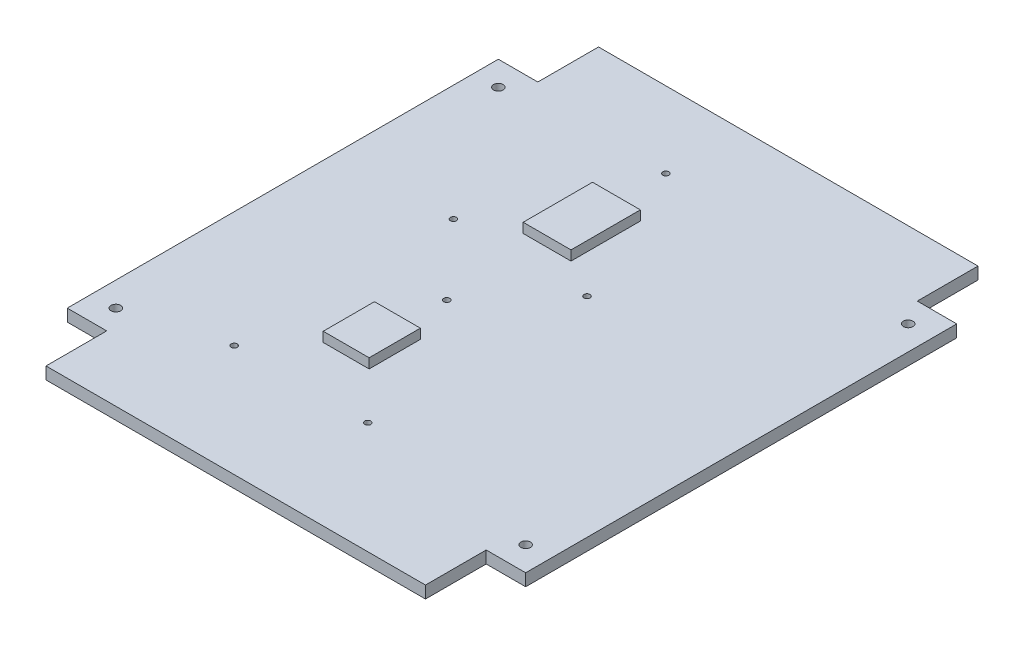
ISO-10303-21;
HEADER;
FILE_DESCRIPTION(('STEP AP214'),'2;1');
FILE_NAME('part.step','',(''),(''),'','','');
FILE_SCHEMA(('AUTOMOTIVE_DESIGN { 1 0 10303 214 1 1 1 1 }'));
ENDSEC;
DATA;
#1=APPLICATION_CONTEXT('core data for automotive mechanical design processes');
#2=APPLICATION_PROTOCOL_DEFINITION('international standard','automotive_design',2000,#1);
#3=PRODUCT_CONTEXT('',#1,'mechanical');
#4=PRODUCT('Part','Part','',(#3));
#5=PRODUCT_RELATED_PRODUCT_CATEGORY('part','',(#4));
#6=PRODUCT_DEFINITION_FORMATION('','',#4);
#7=PRODUCT_DEFINITION_CONTEXT('part definition',#1,'design');
#8=PRODUCT_DEFINITION('design','',#6,#7);
#9=PRODUCT_DEFINITION_SHAPE('','',#8);
#10=(LENGTH_UNIT() NAMED_UNIT(*) SI_UNIT(.MILLI.,.METRE.));
#11=(NAMED_UNIT(*) PLANE_ANGLE_UNIT() SI_UNIT($,.RADIAN.));
#12=(NAMED_UNIT(*) SI_UNIT($,.STERADIAN.) SOLID_ANGLE_UNIT());
#13=UNCERTAINTY_MEASURE_WITH_UNIT(LENGTH_MEASURE(1.E-05),#10,'distance_accuracy_value','');
#14=(GEOMETRIC_REPRESENTATION_CONTEXT(3) GLOBAL_UNCERTAINTY_ASSIGNED_CONTEXT((#13)) GLOBAL_UNIT_ASSIGNED_CONTEXT((#10,
#11,#12)) REPRESENTATION_CONTEXT('',''));
#15=CARTESIAN_POINT('',(0.,0.,0.));
#16=DIRECTION('',(0.,0.,1.));
#17=DIRECTION('',(1.,0.,0.));
#18=AXIS2_PLACEMENT_3D('',#15,#16,#17);
#19=CARTESIAN_POINT('',(-47.9425,2.54,-45.085));
#20=DIRECTION('',(0.,-1.,0.));
#21=DIRECTION('',(0.,0.,-1.));
#22=AXIS2_PLACEMENT_3D('',#19,#20,#21);
#23=PLANE('',#22);
#24=CARTESIAN_POINT('',(-42.8625,2.54,-40.005));
#25=DIRECTION('',(0.,1.,0.));
#26=DIRECTION('',(0.,0.,1.));
#27=AXIS2_PLACEMENT_3D('',#24,#25,#26);
#28=CIRCLE('',#27,0.999490000000001);
#29=CARTESIAN_POINT('',(-42.8625,2.54,-39.00551));
#30=VERTEX_POINT('',#29);
#31=EDGE_CURVE('E721',#30,#30,#28,.T.);
#32=ORIENTED_EDGE('',*,*,#31,.F.);
#33=EDGE_LOOP('',(#32));
#34=FACE_BOUND('',#33,.T.);
#35=CARTESIAN_POINT('',(-42.8625,2.54,40.005));
#36=DIRECTION('',(0.,1.,0.));
#37=DIRECTION('',(0.,0.,1.));
#38=AXIS2_PLACEMENT_3D('',#35,#36,#37);
#39=CIRCLE('',#38,0.999490000000001);
#40=CARTESIAN_POINT('',(-42.8625,2.54,41.00449));
#41=VERTEX_POINT('',#40);
#42=EDGE_CURVE('E723',#41,#41,#39,.T.);
#43=ORIENTED_EDGE('',*,*,#42,.F.);
#44=EDGE_LOOP('',(#43));
#45=FACE_BOUND('',#44,.T.);
#46=CARTESIAN_POINT('',(42.8625,2.54,-40.005));
#47=DIRECTION('',(0.,1.,0.));
#48=DIRECTION('',(0.,0.,1.));
#49=AXIS2_PLACEMENT_3D('',#46,#47,#48);
#50=CIRCLE('',#49,0.999490000000001);
#51=CARTESIAN_POINT('',(42.8625,2.54,-39.00551));
#52=VERTEX_POINT('',#51);
#53=EDGE_CURVE('E729',#52,#52,#50,.T.);
#54=ORIENTED_EDGE('',*,*,#53,.F.);
#55=EDGE_LOOP('',(#54));
#56=FACE_BOUND('',#55,.T.);
#57=CARTESIAN_POINT('',(42.8625,2.54,40.005));
#58=DIRECTION('',(0.,1.,0.));
#59=DIRECTION('',(0.,0.,1.));
#60=AXIS2_PLACEMENT_3D('',#57,#58,#59);
#61=CIRCLE('',#60,0.999490000000001);
#62=CARTESIAN_POINT('',(42.8625,2.54,41.00449));
#63=VERTEX_POINT('',#62);
#64=EDGE_CURVE('E735',#63,#63,#61,.T.);
#65=ORIENTED_EDGE('',*,*,#64,.F.);
#66=EDGE_LOOP('',(#65));
#67=FACE_BOUND('',#66,.T.);
#68=CARTESIAN_POINT('',(-9.7155,2.54,-41.91));
#69=DIRECTION('',(0.,1.,0.));
#70=DIRECTION('',(0.,0.,1.));
#71=AXIS2_PLACEMENT_3D('',#68,#69,#70);
#72=CIRCLE('',#71,0.635000000000001);
#73=CARTESIAN_POINT('',(-9.7155,2.54,-41.275));
#74=VERTEX_POINT('',#73);
#75=EDGE_CURVE('E741',#74,#74,#72,.T.);
#76=ORIENTED_EDGE('',*,*,#75,.F.);
#77=EDGE_LOOP('',(#76));
#78=FACE_BOUND('',#77,.T.);
#79=CARTESIAN_POINT('',(-23.6855,2.54,-11.43));
#80=DIRECTION('',(0.,1.,0.));
#81=DIRECTION('',(0.,0.,1.));
#82=AXIS2_PLACEMENT_3D('',#79,#80,#81);
#83=CIRCLE('',#82,0.634999999999999);
#84=CARTESIAN_POINT('',(-23.6855,2.54,-10.795));
#85=VERTEX_POINT('',#84);
#86=EDGE_CURVE('E747',#85,#85,#83,.T.);
#87=ORIENTED_EDGE('',*,*,#86,.F.);
#88=EDGE_LOOP('',(#87));
#89=FACE_BOUND('',#88,.T.);
#90=CARTESIAN_POINT('',(4.25449999999999,2.54,-11.43));
#91=DIRECTION('',(0.,1.,0.));
#92=DIRECTION('',(0.,0.,1.));
#93=AXIS2_PLACEMENT_3D('',#90,#91,#92);
#94=CIRCLE('',#93,0.635000000000001);
#95=CARTESIAN_POINT('',(4.25449999999999,2.54,-10.795));
#96=VERTEX_POINT('',#95);
#97=EDGE_CURVE('E753',#96,#96,#94,.T.);
#98=ORIENTED_EDGE('',*,*,#97,.F.);
#99=EDGE_LOOP('',(#98));
#100=FACE_BOUND('',#99,.T.);
#101=CARTESIAN_POINT('',(-9.7155,2.54,3.93700000000002));
#102=DIRECTION('',(0.,1.,0.));
#103=DIRECTION('',(0.,0.,1.));
#104=AXIS2_PLACEMENT_3D('',#101,#102,#103);
#105=CIRCLE('',#104,0.635000000000001);
#106=CARTESIAN_POINT('',(-9.7155,2.54,4.57200000000002));
#107=VERTEX_POINT('',#106);
#108=EDGE_CURVE('E759',#107,#107,#105,.T.);
#109=ORIENTED_EDGE('',*,*,#108,.F.);
#110=EDGE_LOOP('',(#109));
#111=FACE_BOUND('',#110,.T.);
#112=CARTESIAN_POINT('',(-23.6855,2.54,34.417));
#113=DIRECTION('',(0.,1.,0.));
#114=DIRECTION('',(0.,0.,1.));
#115=AXIS2_PLACEMENT_3D('',#112,#113,#114);
#116=CIRCLE('',#115,0.634999999999999);
#117=CARTESIAN_POINT('',(-23.6855,2.54,35.052));
#118=VERTEX_POINT('',#117);
#119=EDGE_CURVE('E765',#118,#118,#116,.T.);
#120=ORIENTED_EDGE('',*,*,#119,.F.);
#121=EDGE_LOOP('',(#120));
#122=FACE_BOUND('',#121,.T.);
#123=CARTESIAN_POINT('',(4.25449999999999,2.54,34.417));
#124=DIRECTION('',(0.,1.,0.));
#125=DIRECTION('',(0.,0.,1.));
#126=AXIS2_PLACEMENT_3D('',#123,#124,#125);
#127=CIRCLE('',#126,0.635000000000001);
#128=CARTESIAN_POINT('',(4.25449999999999,2.54,35.052));
#129=VERTEX_POINT('',#128);
#130=EDGE_CURVE('E771',#129,#129,#127,.T.);
#131=ORIENTED_EDGE('',*,*,#130,.F.);
#132=EDGE_LOOP('',(#131));
#133=FACE_BOUND('',#132,.T.);
#134=DIRECTION('',(0.,0.,-1.));
#135=VECTOR('',#134,1.);
#136=CARTESIAN_POINT('',(-5.3467,2.54,-45.085));
#137=LINE('',#136,#135);
#138=CARTESIAN_POINT('',(-5.3467,2.54,24.5364));
#139=VERTEX_POINT('',#138);
#140=CARTESIAN_POINT('',(-5.3467,2.54,13.8176));
#141=VERTEX_POINT('',#140);
#142=EDGE_CURVE('E236',#139,#141,#137,.T.);
#143=ORIENTED_EDGE('',*,*,#142,.F.);
#144=DIRECTION('',(1.,0.,0.));
#145=VECTOR('',#144,1.);
#146=CARTESIAN_POINT('',(-47.9425,2.54,24.5364));
#147=LINE('',#146,#145);
#148=CARTESIAN_POINT('',(-14.9479,2.54,24.5364));
#149=VERTEX_POINT('',#148);
#150=EDGE_CURVE('E227',#149,#139,#147,.T.);
#151=ORIENTED_EDGE('',*,*,#150,.F.);
#152=DIRECTION('',(0.,0.,1.));
#153=VECTOR('',#152,1.);
#154=CARTESIAN_POINT('',(-14.9479,2.54,-45.085));
#155=LINE('',#154,#153);
#156=CARTESIAN_POINT('',(-14.9479,2.54,13.8176));
#157=VERTEX_POINT('',#156);
#158=EDGE_CURVE('E230',#157,#149,#155,.T.);
#159=ORIENTED_EDGE('',*,*,#158,.F.);
#160=DIRECTION('',(-1.,0.,0.));
#161=VECTOR('',#160,1.);
#162=CARTESIAN_POINT('',(-47.9425,2.54,13.8176));
#163=LINE('',#162,#161);
#164=EDGE_CURVE('E233',#141,#157,#163,.T.);
#165=ORIENTED_EDGE('',*,*,#164,.F.);
#166=EDGE_LOOP('',(#143,#151,#159,#165));
#167=FACE_BOUND('',#166,.T.);
#168=DIRECTION('',(0.,0.,1.));
#169=VECTOR('',#168,1.);
#170=CARTESIAN_POINT('',(-47.9425,2.54,45.085));
#171=LINE('',#170,#169);
#172=CARTESIAN_POINT('',(-47.9425,2.54,-45.085));
#173=VERTEX_POINT('',#172);
#174=CARTESIAN_POINT('',(-47.9425,2.54,45.085));
#175=VERTEX_POINT('',#174);
#176=EDGE_CURVE('E240',#173,#175,#171,.T.);
#177=ORIENTED_EDGE('',*,*,#176,.T.);
#178=DIRECTION('',(1.,0.,0.));
#179=VECTOR('',#178,1.);
#180=CARTESIAN_POINT('',(-47.9425,2.54,45.085));
#181=LINE('',#180,#179);
#182=CARTESIAN_POINT('',(-39.6875,2.54,45.085));
#183=VERTEX_POINT('',#182);
#184=EDGE_CURVE('E243',#175,#183,#181,.T.);
#185=ORIENTED_EDGE('',*,*,#184,.T.);
#186=DIRECTION('',(0.,0.,1.));
#187=VECTOR('',#186,1.);
#188=CARTESIAN_POINT('',(-39.6875,2.54,45.085));
#189=LINE('',#188,#187);
#190=CARTESIAN_POINT('',(-39.6875,2.54,57.785));
#191=VERTEX_POINT('',#190);
#192=EDGE_CURVE('E246',#183,#191,#189,.T.);
#193=ORIENTED_EDGE('',*,*,#192,.T.);
#194=DIRECTION('',(1.,0.,0.));
#195=VECTOR('',#194,1.);
#196=CARTESIAN_POINT('',(39.6875,2.54,57.785));
#197=LINE('',#196,#195);
#198=CARTESIAN_POINT('',(39.6875,2.54,57.785));
#199=VERTEX_POINT('',#198);
#200=EDGE_CURVE('E248',#191,#199,#197,.T.);
#201=ORIENTED_EDGE('',*,*,#200,.T.);
#202=DIRECTION('',(0.,0.,-1.));
#203=VECTOR('',#202,1.);
#204=CARTESIAN_POINT('',(39.6875,2.54,45.085));
#205=LINE('',#204,#203);
#206=CARTESIAN_POINT('',(39.6875,2.54,45.085));
#207=VERTEX_POINT('',#206);
#208=EDGE_CURVE('E250',#199,#207,#205,.T.);
#209=ORIENTED_EDGE('',*,*,#208,.T.);
#210=DIRECTION('',(1.,0.,0.));
#211=VECTOR('',#210,1.);
#212=CARTESIAN_POINT('',(47.9425,2.54,45.085));
#213=LINE('',#212,#211);
#214=CARTESIAN_POINT('',(47.9425,2.54,45.085));
#215=VERTEX_POINT('',#214);
#216=EDGE_CURVE('E252',#207,#215,#213,.T.);
#217=ORIENTED_EDGE('',*,*,#216,.T.);
#218=DIRECTION('',(0.,0.,-1.));
#219=VECTOR('',#218,1.);
#220=CARTESIAN_POINT('',(47.9425,2.54,45.085));
#221=LINE('',#220,#219);
#222=CARTESIAN_POINT('',(47.9425,2.54,-45.085));
#223=VERTEX_POINT('',#222);
#224=EDGE_CURVE('E254',#215,#223,#221,.T.);
#225=ORIENTED_EDGE('',*,*,#224,.T.);
#226=DIRECTION('',(-1.,0.,0.));
#227=VECTOR('',#226,1.);
#228=CARTESIAN_POINT('',(47.9425,2.54,-45.085));
#229=LINE('',#228,#227);
#230=CARTESIAN_POINT('',(39.6875,2.54,-45.085));
#231=VERTEX_POINT('',#230);
#232=EDGE_CURVE('E256',#223,#231,#229,.T.);
#233=ORIENTED_EDGE('',*,*,#232,.T.);
#234=DIRECTION('',(0.,0.,-1.));
#235=VECTOR('',#234,1.);
#236=CARTESIAN_POINT('',(39.6875,2.54,-45.085));
#237=LINE('',#236,#235);
#238=CARTESIAN_POINT('',(39.6875,2.54,-57.785));
#239=VERTEX_POINT('',#238);
#240=EDGE_CURVE('E258',#231,#239,#237,.T.);
#241=ORIENTED_EDGE('',*,*,#240,.T.);
#242=DIRECTION('',(-1.,0.,0.));
#243=VECTOR('',#242,1.);
#244=CARTESIAN_POINT('',(39.6875,2.54,-57.785));
#245=LINE('',#244,#243);
#246=CARTESIAN_POINT('',(-39.6875,2.54,-57.785));
#247=VERTEX_POINT('',#246);
#248=EDGE_CURVE('E260',#239,#247,#245,.T.);
#249=ORIENTED_EDGE('',*,*,#248,.T.);
#250=DIRECTION('',(0.,0.,1.));
#251=VECTOR('',#250,1.);
#252=CARTESIAN_POINT('',(-39.6875,2.54,-45.085));
#253=LINE('',#252,#251);
#254=CARTESIAN_POINT('',(-39.6875,2.54,-45.085));
#255=VERTEX_POINT('',#254);
#256=EDGE_CURVE('E262',#247,#255,#253,.T.);
#257=ORIENTED_EDGE('',*,*,#256,.T.);
#258=DIRECTION('',(-1.,0.,0.));
#259=VECTOR('',#258,1.);
#260=CARTESIAN_POINT('',(-47.9425,2.54,-45.085));
#261=LINE('',#260,#259);
#262=EDGE_CURVE('E264',#255,#173,#261,.T.);
#263=ORIENTED_EDGE('',*,*,#262,.T.);
#264=EDGE_LOOP('',(#177,#185,#193,#201,#209,#217,#225,#233,#241,#249,#257,#263));
#265=FACE_BOUND('',#264,.T.);
#266=DIRECTION('',(0.,0.,1.));
#267=VECTOR('',#266,1.);
#268=CARTESIAN_POINT('',(-13.7795,2.54,-45.085));
#269=LINE('',#268,#267);
#270=CARTESIAN_POINT('',(-13.7795,2.54,-30.6197));
#271=VERTEX_POINT('',#270);
#272=CARTESIAN_POINT('',(-13.7795,2.54,-16.1163));
#273=VERTEX_POINT('',#272);
#274=EDGE_CURVE('E194',#271,#273,#269,.T.);
#275=ORIENTED_EDGE('',*,*,#274,.F.);
#276=DIRECTION('',(-1.,0.,0.));
#277=VECTOR('',#276,1.);
#278=CARTESIAN_POINT('',(-47.9425,2.54,-30.6197));
#279=LINE('',#278,#277);
#280=CARTESIAN_POINT('',(-3.7719,2.54,-30.6197));
#281=VERTEX_POINT('',#280);
#282=EDGE_CURVE('E195',#281,#271,#279,.T.);
#283=ORIENTED_EDGE('',*,*,#282,.F.);
#284=DIRECTION('',(0.,0.,-1.));
#285=VECTOR('',#284,1.);
#286=CARTESIAN_POINT('',(-3.7719,2.54,-45.085));
#287=LINE('',#286,#285);
#288=CARTESIAN_POINT('',(-3.7719,2.54,-16.1163));
#289=VERTEX_POINT('',#288);
#290=EDGE_CURVE('E57',#289,#281,#287,.T.);
#291=ORIENTED_EDGE('',*,*,#290,.F.);
#292=DIRECTION('',(1.,0.,0.));
#293=VECTOR('',#292,1.);
#294=CARTESIAN_POINT('',(-47.9425,2.54,-16.1163));
#295=LINE('',#294,#293);
#296=EDGE_CURVE('E52',#273,#289,#295,.T.);
#297=ORIENTED_EDGE('',*,*,#296,.F.);
#298=EDGE_LOOP('',(#275,#283,#291,#297));
#299=FACE_BOUND('',#298,.T.);
#300=ADVANCED_FACE('F37',(#34,#45,#56,#67,#78,#89,#100,#111,#122,#133,#167,#265,#299),#23,.F.);
#301=CARTESIAN_POINT('',(-47.9425,2.54,45.085));
#302=DIRECTION('',(1.,0.,0.));
#303=DIRECTION('',(0.,0.,-1.));
#304=AXIS2_PLACEMENT_3D('',#301,#302,#303);
#305=PLANE('',#304);
#306=DIRECTION('',(0.,0.,1.));
#307=VECTOR('',#306,1.);
#308=CARTESIAN_POINT('',(-47.9425,0.,45.085));
#309=LINE('',#308,#307);
#310=CARTESIAN_POINT('',(-47.9425,0.,-45.085));
#311=VERTEX_POINT('',#310);
#312=CARTESIAN_POINT('',(-47.9425,0.,45.085));
#313=VERTEX_POINT('',#312);
#314=EDGE_CURVE('E239',#311,#313,#309,.T.);
#315=ORIENTED_EDGE('',*,*,#314,.T.);
#316=DIRECTION('',(0.,-1.,0.));
#317=VECTOR('',#316,1.);
#318=CARTESIAN_POINT('',(-47.9425,2.54,45.085));
#319=LINE('',#318,#317);
#320=EDGE_CURVE('E11',#175,#313,#319,.T.);
#321=ORIENTED_EDGE('',*,*,#320,.F.);
#322=ORIENTED_EDGE('',*,*,#176,.F.);
#323=DIRECTION('',(0.,-1.,0.));
#324=VECTOR('',#323,1.);
#325=CARTESIAN_POINT('',(-47.9425,2.54,-45.085));
#326=LINE('',#325,#324);
#327=EDGE_CURVE('E266',#173,#311,#326,.T.);
#328=ORIENTED_EDGE('',*,*,#327,.T.);
#329=EDGE_LOOP('',(#315,#321,#322,#328));
#330=FACE_BOUND('',#329,.T.);
#331=ADVANCED_FACE('F39',(#330),#305,.F.);
#332=CARTESIAN_POINT('',(-47.9425,2.54,45.085));
#333=DIRECTION('',(0.,0.,-1.));
#334=DIRECTION('',(-1.,0.,0.));
#335=AXIS2_PLACEMENT_3D('',#332,#333,#334);
#336=PLANE('',#335);
#337=DIRECTION('',(1.,0.,0.));
#338=VECTOR('',#337,1.);
#339=CARTESIAN_POINT('',(-47.9425,0.,45.085));
#340=LINE('',#339,#338);
#341=CARTESIAN_POINT('',(-39.6875,0.,45.085));
#342=VERTEX_POINT('',#341);
#343=EDGE_CURVE('E269',#313,#342,#340,.T.);
#344=ORIENTED_EDGE('',*,*,#343,.T.);
#345=DIRECTION('',(0.,-1.,0.));
#346=VECTOR('',#345,1.);
#347=CARTESIAN_POINT('',(-39.6875,2.54,45.085));
#348=LINE('',#347,#346);
#349=EDGE_CURVE('E45',#183,#342,#348,.T.);
#350=ORIENTED_EDGE('',*,*,#349,.F.);
#351=ORIENTED_EDGE('',*,*,#184,.F.);
#352=ORIENTED_EDGE('',*,*,#320,.T.);
#353=EDGE_LOOP('',(#344,#350,#351,#352));
#354=FACE_BOUND('',#353,.T.);
#355=ADVANCED_FACE('F345',(#354),#336,.F.);
#356=CARTESIAN_POINT('',(-39.6875,2.54,45.085));
#357=DIRECTION('',(1.,0.,0.));
#358=DIRECTION('',(0.,0.,-1.));
#359=AXIS2_PLACEMENT_3D('',#356,#357,#358);
#360=PLANE('',#359);
#361=DIRECTION('',(0.,0.,1.));
#362=VECTOR('',#361,1.);
#363=CARTESIAN_POINT('',(-39.6875,0.,45.085));
#364=LINE('',#363,#362);
#365=CARTESIAN_POINT('',(-39.6875,0.,57.785));
#366=VERTEX_POINT('',#365);
#367=EDGE_CURVE('E271',#342,#366,#364,.T.);
#368=ORIENTED_EDGE('',*,*,#367,.T.);
#369=DIRECTION('',(0.,-1.,0.));
#370=VECTOR('',#369,1.);
#371=CARTESIAN_POINT('',(-39.6875,2.54,57.785));
#372=LINE('',#371,#370);
#373=EDGE_CURVE('E316',#191,#366,#372,.T.);
#374=ORIENTED_EDGE('',*,*,#373,.F.);
#375=ORIENTED_EDGE('',*,*,#192,.F.);
#376=ORIENTED_EDGE('',*,*,#349,.T.);
#377=EDGE_LOOP('',(#368,#374,#375,#376));
#378=FACE_BOUND('',#377,.T.);
#379=ADVANCED_FACE('F323',(#378),#360,.F.);
#380=CARTESIAN_POINT('',(39.6875,2.54,57.785));
#381=DIRECTION('',(0.,0.,-1.));
#382=DIRECTION('',(-1.,0.,0.));
#383=AXIS2_PLACEMENT_3D('',#380,#381,#382);
#384=PLANE('',#383);
#385=DIRECTION('',(1.,0.,0.));
#386=VECTOR('',#385,1.);
#387=CARTESIAN_POINT('',(39.6875,0.,57.785));
#388=LINE('',#387,#386);
#389=CARTESIAN_POINT('',(39.6875,0.,57.785));
#390=VERTEX_POINT('',#389);
#391=EDGE_CURVE('E273',#366,#390,#388,.T.);
#392=ORIENTED_EDGE('',*,*,#391,.T.);
#393=DIRECTION('',(0.,-1.,0.));
#394=VECTOR('',#393,1.);
#395=CARTESIAN_POINT('',(39.6875,2.54,57.785));
#396=LINE('',#395,#394);
#397=EDGE_CURVE('E313',#199,#390,#396,.T.);
#398=ORIENTED_EDGE('',*,*,#397,.F.);
#399=ORIENTED_EDGE('',*,*,#200,.F.);
#400=ORIENTED_EDGE('',*,*,#373,.T.);
#401=EDGE_LOOP('',(#392,#398,#399,#400));
#402=FACE_BOUND('',#401,.T.);
#403=ADVANCED_FACE('F334',(#402),#384,.F.);
#404=CARTESIAN_POINT('',(39.6875,2.54,45.085));
#405=DIRECTION('',(-1.,0.,0.));
#406=DIRECTION('',(0.,0.,1.));
#407=AXIS2_PLACEMENT_3D('',#404,#405,#406);
#408=PLANE('',#407);
#409=DIRECTION('',(0.,0.,-1.));
#410=VECTOR('',#409,1.);
#411=CARTESIAN_POINT('',(39.6875,0.,45.085));
#412=LINE('',#411,#410);
#413=CARTESIAN_POINT('',(39.6875,0.,45.085));
#414=VERTEX_POINT('',#413);
#415=EDGE_CURVE('E275',#390,#414,#412,.T.);
#416=ORIENTED_EDGE('',*,*,#415,.T.);
#417=DIRECTION('',(0.,-1.,0.));
#418=VECTOR('',#417,1.);
#419=CARTESIAN_POINT('',(39.6875,2.54,45.085));
#420=LINE('',#419,#418);
#421=EDGE_CURVE('E310',#207,#414,#420,.T.);
#422=ORIENTED_EDGE('',*,*,#421,.F.);
#423=ORIENTED_EDGE('',*,*,#208,.F.);
#424=ORIENTED_EDGE('',*,*,#397,.T.);
#425=EDGE_LOOP('',(#416,#422,#423,#424));
#426=FACE_BOUND('',#425,.T.);
#427=ADVANCED_FACE('F338',(#426),#408,.F.);
#428=CARTESIAN_POINT('',(47.9425,2.54,45.085));
#429=DIRECTION('',(0.,0.,-1.));
#430=DIRECTION('',(-1.,0.,0.));
#431=AXIS2_PLACEMENT_3D('',#428,#429,#430);
#432=PLANE('',#431);
#433=DIRECTION('',(1.,0.,0.));
#434=VECTOR('',#433,1.);
#435=CARTESIAN_POINT('',(47.9425,0.,45.085));
#436=LINE('',#435,#434);
#437=CARTESIAN_POINT('',(47.9425,0.,45.085));
#438=VERTEX_POINT('',#437);
#439=EDGE_CURVE('E277',#414,#438,#436,.T.);
#440=ORIENTED_EDGE('',*,*,#439,.T.);
#441=DIRECTION('',(0.,-1.,0.));
#442=VECTOR('',#441,1.);
#443=CARTESIAN_POINT('',(47.9425,2.54,45.085));
#444=LINE('',#443,#442);
#445=EDGE_CURVE('E307',#215,#438,#444,.T.);
#446=ORIENTED_EDGE('',*,*,#445,.F.);
#447=ORIENTED_EDGE('',*,*,#216,.F.);
#448=ORIENTED_EDGE('',*,*,#421,.T.);
#449=EDGE_LOOP('',(#440,#446,#447,#448));
#450=FACE_BOUND('',#449,.T.);
#451=ADVANCED_FACE('F378',(#450),#432,.F.);
#452=CARTESIAN_POINT('',(47.9425,2.54,45.085));
#453=DIRECTION('',(-1.,0.,0.));
#454=DIRECTION('',(0.,0.,1.));
#455=AXIS2_PLACEMENT_3D('',#452,#453,#454);
#456=PLANE('',#455);
#457=DIRECTION('',(0.,0.,-1.));
#458=VECTOR('',#457,1.);
#459=CARTESIAN_POINT('',(47.9425,0.,45.085));
#460=LINE('',#459,#458);
#461=CARTESIAN_POINT('',(47.9425,0.,-45.085));
#462=VERTEX_POINT('',#461);
#463=EDGE_CURVE('E279',#438,#462,#460,.T.);
#464=ORIENTED_EDGE('',*,*,#463,.T.);
#465=DIRECTION('',(0.,-1.,0.));
#466=VECTOR('',#465,1.);
#467=CARTESIAN_POINT('',(47.9425,2.54,-45.085));
#468=LINE('',#467,#466);
#469=EDGE_CURVE('E304',#223,#462,#468,.T.);
#470=ORIENTED_EDGE('',*,*,#469,.F.);
#471=ORIENTED_EDGE('',*,*,#224,.F.);
#472=ORIENTED_EDGE('',*,*,#445,.T.);
#473=EDGE_LOOP('',(#464,#470,#471,#472));
#474=FACE_BOUND('',#473,.T.);
#475=ADVANCED_FACE('F376',(#474),#456,.F.);
#476=CARTESIAN_POINT('',(47.9425,2.54,-45.085));
#477=DIRECTION('',(0.,0.,1.));
#478=DIRECTION('',(1.,0.,0.));
#479=AXIS2_PLACEMENT_3D('',#476,#477,#478);
#480=PLANE('',#479);
#481=DIRECTION('',(-1.,0.,0.));
#482=VECTOR('',#481,1.);
#483=CARTESIAN_POINT('',(47.9425,0.,-45.085));
#484=LINE('',#483,#482);
#485=CARTESIAN_POINT('',(39.6875,0.,-45.085));
#486=VERTEX_POINT('',#485);
#487=EDGE_CURVE('E281',#462,#486,#484,.T.);
#488=ORIENTED_EDGE('',*,*,#487,.T.);
#489=DIRECTION('',(0.,-1.,0.));
#490=VECTOR('',#489,1.);
#491=CARTESIAN_POINT('',(39.6875,2.54,-45.085));
#492=LINE('',#491,#490);
#493=EDGE_CURVE('E301',#231,#486,#492,.T.);
#494=ORIENTED_EDGE('',*,*,#493,.F.);
#495=ORIENTED_EDGE('',*,*,#232,.F.);
#496=ORIENTED_EDGE('',*,*,#469,.T.);
#497=EDGE_LOOP('',(#488,#494,#495,#496));
#498=FACE_BOUND('',#497,.T.);
#499=ADVANCED_FACE('F372',(#498),#480,.F.);
#500=CARTESIAN_POINT('',(39.6875,2.54,-45.085));
#501=DIRECTION('',(-1.,0.,0.));
#502=DIRECTION('',(0.,0.,1.));
#503=AXIS2_PLACEMENT_3D('',#500,#501,#502);
#504=PLANE('',#503);
#505=DIRECTION('',(0.,0.,-1.));
#506=VECTOR('',#505,1.);
#507=CARTESIAN_POINT('',(39.6875,0.,-45.085));
#508=LINE('',#507,#506);
#509=CARTESIAN_POINT('',(39.6875,0.,-57.785));
#510=VERTEX_POINT('',#509);
#511=EDGE_CURVE('E283',#486,#510,#508,.T.);
#512=ORIENTED_EDGE('',*,*,#511,.T.);
#513=DIRECTION('',(0.,-1.,0.));
#514=VECTOR('',#513,1.);
#515=CARTESIAN_POINT('',(39.6875,2.54,-57.785));
#516=LINE('',#515,#514);
#517=EDGE_CURVE('E298',#239,#510,#516,.T.);
#518=ORIENTED_EDGE('',*,*,#517,.F.);
#519=ORIENTED_EDGE('',*,*,#240,.F.);
#520=ORIENTED_EDGE('',*,*,#493,.T.);
#521=EDGE_LOOP('',(#512,#518,#519,#520));
#522=FACE_BOUND('',#521,.T.);
#523=ADVANCED_FACE('F367',(#522),#504,.F.);
#524=CARTESIAN_POINT('',(39.6875,2.54,-57.785));
#525=DIRECTION('',(0.,0.,1.));
#526=DIRECTION('',(1.,0.,0.));
#527=AXIS2_PLACEMENT_3D('',#524,#525,#526);
#528=PLANE('',#527);
#529=DIRECTION('',(-1.,0.,0.));
#530=VECTOR('',#529,1.);
#531=CARTESIAN_POINT('',(39.6875,0.,-57.785));
#532=LINE('',#531,#530);
#533=CARTESIAN_POINT('',(-39.6875,0.,-57.785));
#534=VERTEX_POINT('',#533);
#535=EDGE_CURVE('E285',#510,#534,#532,.T.);
#536=ORIENTED_EDGE('',*,*,#535,.T.);
#537=DIRECTION('',(0.,-1.,0.));
#538=VECTOR('',#537,1.);
#539=CARTESIAN_POINT('',(-39.6875,2.54,-57.785));
#540=LINE('',#539,#538);
#541=EDGE_CURVE('E295',#247,#534,#540,.T.);
#542=ORIENTED_EDGE('',*,*,#541,.F.);
#543=ORIENTED_EDGE('',*,*,#248,.F.);
#544=ORIENTED_EDGE('',*,*,#517,.T.);
#545=EDGE_LOOP('',(#536,#542,#543,#544));
#546=FACE_BOUND('',#545,.T.);
#547=ADVANCED_FACE('F361',(#546),#528,.F.);
#548=CARTESIAN_POINT('',(-39.6875,2.54,-45.085));
#549=DIRECTION('',(1.,0.,0.));
#550=DIRECTION('',(0.,0.,-1.));
#551=AXIS2_PLACEMENT_3D('',#548,#549,#550);
#552=PLANE('',#551);
#553=DIRECTION('',(0.,0.,1.));
#554=VECTOR('',#553,1.);
#555=CARTESIAN_POINT('',(-39.6875,0.,-45.085));
#556=LINE('',#555,#554);
#557=CARTESIAN_POINT('',(-39.6875,0.,-45.085));
#558=VERTEX_POINT('',#557);
#559=EDGE_CURVE('E287',#534,#558,#556,.T.);
#560=ORIENTED_EDGE('',*,*,#559,.T.);
#561=DIRECTION('',(0.,-1.,0.));
#562=VECTOR('',#561,1.);
#563=CARTESIAN_POINT('',(-39.6875,2.54,-45.085));
#564=LINE('',#563,#562);
#565=EDGE_CURVE('E292',#255,#558,#564,.T.);
#566=ORIENTED_EDGE('',*,*,#565,.F.);
#567=ORIENTED_EDGE('',*,*,#256,.F.);
#568=ORIENTED_EDGE('',*,*,#541,.T.);
#569=EDGE_LOOP('',(#560,#566,#567,#568));
#570=FACE_BOUND('',#569,.T.);
#571=ADVANCED_FACE('F357',(#570),#552,.F.);
#572=CARTESIAN_POINT('',(-47.9425,2.54,-45.085));
#573=DIRECTION('',(0.,0.,1.));
#574=DIRECTION('',(1.,0.,0.));
#575=AXIS2_PLACEMENT_3D('',#572,#573,#574);
#576=PLANE('',#575);
#577=DIRECTION('',(-1.,0.,0.));
#578=VECTOR('',#577,1.);
#579=CARTESIAN_POINT('',(-47.9425,0.,-45.085));
#580=LINE('',#579,#578);
#581=EDGE_CURVE('E244',#558,#311,#580,.T.);
#582=ORIENTED_EDGE('',*,*,#581,.T.);
#583=ORIENTED_EDGE('',*,*,#327,.F.);
#584=ORIENTED_EDGE('',*,*,#262,.F.);
#585=ORIENTED_EDGE('',*,*,#565,.T.);
#586=EDGE_LOOP('',(#582,#583,#584,#585));
#587=FACE_BOUND('',#586,.T.);
#588=ADVANCED_FACE('F352',(#587),#576,.F.);
#589=CARTESIAN_POINT('',(-47.9425,0.,-45.085));
#590=DIRECTION('',(0.,-1.,0.));
#591=DIRECTION('',(0.,0.,-1.));
#592=AXIS2_PLACEMENT_3D('',#589,#590,#591);
#593=PLANE('',#592);
#594=CARTESIAN_POINT('',(-42.8625,0.,-40.005));
#595=DIRECTION('',(0.,1.,0.));
#596=DIRECTION('',(0.,0.,1.));
#597=AXIS2_PLACEMENT_3D('',#594,#595,#596);
#598=CIRCLE('',#597,0.999490000000001);
#599=CARTESIAN_POINT('',(-42.8625,0.,-39.00551));
#600=VERTEX_POINT('',#599);
#601=EDGE_CURVE('E719',#600,#600,#598,.T.);
#602=ORIENTED_EDGE('',*,*,#601,.T.);
#603=EDGE_LOOP('',(#602));
#604=FACE_BOUND('',#603,.T.);
#605=CARTESIAN_POINT('',(-42.8625,0.,40.005));
#606=DIRECTION('',(0.,1.,0.));
#607=DIRECTION('',(0.,0.,1.));
#608=AXIS2_PLACEMENT_3D('',#605,#606,#607);
#609=CIRCLE('',#608,0.999490000000001);
#610=CARTESIAN_POINT('',(-42.8625,0.,41.00449));
#611=VERTEX_POINT('',#610);
#612=EDGE_CURVE('E726',#611,#611,#609,.T.);
#613=ORIENTED_EDGE('',*,*,#612,.T.);
#614=EDGE_LOOP('',(#613));
#615=FACE_BOUND('',#614,.T.);
#616=CARTESIAN_POINT('',(42.8625,0.,-40.005));
#617=DIRECTION('',(0.,1.,0.));
#618=DIRECTION('',(0.,0.,1.));
#619=AXIS2_PLACEMENT_3D('',#616,#617,#618);
#620=CIRCLE('',#619,0.999490000000001);
#621=CARTESIAN_POINT('',(42.8625,0.,-39.00551));
#622=VERTEX_POINT('',#621);
#623=EDGE_CURVE('E732',#622,#622,#620,.T.);
#624=ORIENTED_EDGE('',*,*,#623,.T.);
#625=EDGE_LOOP('',(#624));
#626=FACE_BOUND('',#625,.T.);
#627=CARTESIAN_POINT('',(42.8625,0.,40.005));
#628=DIRECTION('',(0.,1.,0.));
#629=DIRECTION('',(0.,0.,1.));
#630=AXIS2_PLACEMENT_3D('',#627,#628,#629);
#631=CIRCLE('',#630,0.999490000000001);
#632=CARTESIAN_POINT('',(42.8625,0.,41.00449));
#633=VERTEX_POINT('',#632);
#634=EDGE_CURVE('E738',#633,#633,#631,.T.);
#635=ORIENTED_EDGE('',*,*,#634,.T.);
#636=EDGE_LOOP('',(#635));
#637=FACE_BOUND('',#636,.T.);
#638=CARTESIAN_POINT('',(-9.7155,0.,-41.91));
#639=DIRECTION('',(0.,1.,0.));
#640=DIRECTION('',(0.,0.,1.));
#641=AXIS2_PLACEMENT_3D('',#638,#639,#640);
#642=CIRCLE('',#641,0.635000000000001);
#643=CARTESIAN_POINT('',(-9.7155,0.,-41.275));
#644=VERTEX_POINT('',#643);
#645=EDGE_CURVE('E744',#644,#644,#642,.T.);
#646=ORIENTED_EDGE('',*,*,#645,.T.);
#647=EDGE_LOOP('',(#646));
#648=FACE_BOUND('',#647,.T.);
#649=CARTESIAN_POINT('',(-23.6855,0.,-11.43));
#650=DIRECTION('',(0.,1.,0.));
#651=DIRECTION('',(0.,0.,1.));
#652=AXIS2_PLACEMENT_3D('',#649,#650,#651);
#653=CIRCLE('',#652,0.634999999999999);
#654=CARTESIAN_POINT('',(-23.6855,0.,-10.795));
#655=VERTEX_POINT('',#654);
#656=EDGE_CURVE('E750',#655,#655,#653,.T.);
#657=ORIENTED_EDGE('',*,*,#656,.T.);
#658=EDGE_LOOP('',(#657));
#659=FACE_BOUND('',#658,.T.);
#660=CARTESIAN_POINT('',(4.25449999999999,0.,-11.43));
#661=DIRECTION('',(0.,1.,0.));
#662=DIRECTION('',(0.,0.,1.));
#663=AXIS2_PLACEMENT_3D('',#660,#661,#662);
#664=CIRCLE('',#663,0.635000000000001);
#665=CARTESIAN_POINT('',(4.25449999999999,0.,-10.795));
#666=VERTEX_POINT('',#665);
#667=EDGE_CURVE('E756',#666,#666,#664,.T.);
#668=ORIENTED_EDGE('',*,*,#667,.T.);
#669=EDGE_LOOP('',(#668));
#670=FACE_BOUND('',#669,.T.);
#671=CARTESIAN_POINT('',(-9.7155,0.,3.93700000000002));
#672=DIRECTION('',(0.,1.,0.));
#673=DIRECTION('',(0.,0.,1.));
#674=AXIS2_PLACEMENT_3D('',#671,#672,#673);
#675=CIRCLE('',#674,0.635000000000001);
#676=CARTESIAN_POINT('',(-9.7155,0.,4.57200000000002));
#677=VERTEX_POINT('',#676);
#678=EDGE_CURVE('E762',#677,#677,#675,.T.);
#679=ORIENTED_EDGE('',*,*,#678,.T.);
#680=EDGE_LOOP('',(#679));
#681=FACE_BOUND('',#680,.T.);
#682=CARTESIAN_POINT('',(-23.6855,0.,34.417));
#683=DIRECTION('',(0.,1.,0.));
#684=DIRECTION('',(0.,0.,1.));
#685=AXIS2_PLACEMENT_3D('',#682,#683,#684);
#686=CIRCLE('',#685,0.634999999999999);
#687=CARTESIAN_POINT('',(-23.6855,0.,35.052));
#688=VERTEX_POINT('',#687);
#689=EDGE_CURVE('E768',#688,#688,#686,.T.);
#690=ORIENTED_EDGE('',*,*,#689,.T.);
#691=EDGE_LOOP('',(#690));
#692=FACE_BOUND('',#691,.T.);
#693=CARTESIAN_POINT('',(4.25449999999999,0.,34.417));
#694=DIRECTION('',(0.,1.,0.));
#695=DIRECTION('',(0.,0.,1.));
#696=AXIS2_PLACEMENT_3D('',#693,#694,#695);
#697=CIRCLE('',#696,0.635000000000001);
#698=CARTESIAN_POINT('',(4.25449999999999,0.,35.052));
#699=VERTEX_POINT('',#698);
#700=EDGE_CURVE('E191',#699,#699,#697,.T.);
#701=ORIENTED_EDGE('',*,*,#700,.T.);
#702=EDGE_LOOP('',(#701));
#703=FACE_BOUND('',#702,.T.);
#704=ORIENTED_EDGE('',*,*,#314,.F.);
#705=ORIENTED_EDGE('',*,*,#581,.F.);
#706=ORIENTED_EDGE('',*,*,#559,.F.);
#707=ORIENTED_EDGE('',*,*,#535,.F.);
#708=ORIENTED_EDGE('',*,*,#511,.F.);
#709=ORIENTED_EDGE('',*,*,#487,.F.);
#710=ORIENTED_EDGE('',*,*,#463,.F.);
#711=ORIENTED_EDGE('',*,*,#439,.F.);
#712=ORIENTED_EDGE('',*,*,#415,.F.);
#713=ORIENTED_EDGE('',*,*,#391,.F.);
#714=ORIENTED_EDGE('',*,*,#367,.F.);
#715=ORIENTED_EDGE('',*,*,#343,.F.);
#716=EDGE_LOOP('',(#704,#705,#706,#707,#708,#709,#710,#711,#712,#713,#714,#715));
#717=FACE_BOUND('',#716,.T.);
#718=ADVANCED_FACE('F329',(#604,#615,#626,#637,#648,#659,#670,#681,#692,#703,#717),#593,.T.);
#719=CARTESIAN_POINT('',(-5.3467,4.572,24.5364));
#720=DIRECTION('',(-1.,0.,0.));
#721=DIRECTION('',(0.,0.,1.));
#722=AXIS2_PLACEMENT_3D('',#719,#720,#721);
#723=PLANE('',#722);
#724=DIRECTION('',(0.,-1.,0.));
#725=VECTOR('',#724,1.);
#726=CARTESIAN_POINT('',(-5.3467,4.572,24.5364));
#727=LINE('',#726,#725);
#728=CARTESIAN_POINT('',(-5.3467,4.572,24.5364));
#729=VERTEX_POINT('',#728);
#730=EDGE_CURVE('E215',#729,#139,#727,.T.);
#731=ORIENTED_EDGE('',*,*,#730,.T.);
#732=ORIENTED_EDGE('',*,*,#142,.T.);
#733=DIRECTION('',(0.,-1.,0.));
#734=VECTOR('',#733,1.);
#735=CARTESIAN_POINT('',(-5.3467,4.572,13.8176));
#736=LINE('',#735,#734);
#737=CARTESIAN_POINT('',(-5.3467,4.572,13.8176));
#738=VERTEX_POINT('',#737);
#739=EDGE_CURVE('E224',#738,#141,#736,.T.);
#740=ORIENTED_EDGE('',*,*,#739,.F.);
#741=DIRECTION('',(0.,0.,-1.));
#742=VECTOR('',#741,1.);
#743=CARTESIAN_POINT('',(-5.3467,4.572,24.5364));
#744=LINE('',#743,#742);
#745=EDGE_CURVE('E206',#729,#738,#744,.T.);
#746=ORIENTED_EDGE('',*,*,#745,.F.);
#747=EDGE_LOOP('',(#731,#732,#740,#746));
#748=FACE_BOUND('',#747,.T.);
#749=ADVANCED_FACE('F399',(#748),#723,.F.);
#750=CARTESIAN_POINT('',(-14.9479,4.572,13.8176));
#751=DIRECTION('',(0.,0.,1.));
#752=DIRECTION('',(1.,0.,0.));
#753=AXIS2_PLACEMENT_3D('',#750,#751,#752);
#754=PLANE('',#753);
#755=ORIENTED_EDGE('',*,*,#739,.T.);
#756=ORIENTED_EDGE('',*,*,#164,.T.);
#757=DIRECTION('',(0.,-1.,0.));
#758=VECTOR('',#757,1.);
#759=CARTESIAN_POINT('',(-14.9479,4.572,13.8176));
#760=LINE('',#759,#758);
#761=CARTESIAN_POINT('',(-14.9479,4.572,13.8176));
#762=VERTEX_POINT('',#761);
#763=EDGE_CURVE('E221',#762,#157,#760,.T.);
#764=ORIENTED_EDGE('',*,*,#763,.F.);
#765=DIRECTION('',(-1.,0.,0.));
#766=VECTOR('',#765,1.);
#767=CARTESIAN_POINT('',(-14.9479,4.572,13.8176));
#768=LINE('',#767,#766);
#769=EDGE_CURVE('E209',#738,#762,#768,.T.);
#770=ORIENTED_EDGE('',*,*,#769,.F.);
#771=EDGE_LOOP('',(#755,#756,#764,#770));
#772=FACE_BOUND('',#771,.T.);
#773=ADVANCED_FACE('F531',(#772),#754,.F.);
#774=CARTESIAN_POINT('',(-14.9479,4.572,24.5364));
#775=DIRECTION('',(1.,0.,0.));
#776=DIRECTION('',(0.,0.,-1.));
#777=AXIS2_PLACEMENT_3D('',#774,#775,#776);
#778=PLANE('',#777);
#779=ORIENTED_EDGE('',*,*,#763,.T.);
#780=ORIENTED_EDGE('',*,*,#158,.T.);
#781=DIRECTION('',(0.,-1.,0.));
#782=VECTOR('',#781,1.);
#783=CARTESIAN_POINT('',(-14.9479,4.572,24.5364));
#784=LINE('',#783,#782);
#785=CARTESIAN_POINT('',(-14.9479,4.572,24.5364));
#786=VERTEX_POINT('',#785);
#787=EDGE_CURVE('E218',#786,#149,#784,.T.);
#788=ORIENTED_EDGE('',*,*,#787,.F.);
#789=DIRECTION('',(0.,0.,1.));
#790=VECTOR('',#789,1.);
#791=CARTESIAN_POINT('',(-14.9479,4.572,24.5364));
#792=LINE('',#791,#790);
#793=EDGE_CURVE('E211',#762,#786,#792,.T.);
#794=ORIENTED_EDGE('',*,*,#793,.F.);
#795=EDGE_LOOP('',(#779,#780,#788,#794));
#796=FACE_BOUND('',#795,.T.);
#797=ADVANCED_FACE('F539',(#796),#778,.F.);
#798=CARTESIAN_POINT('',(-14.9479,4.572,24.5364));
#799=DIRECTION('',(0.,0.,-1.));
#800=DIRECTION('',(-1.,0.,0.));
#801=AXIS2_PLACEMENT_3D('',#798,#799,#800);
#802=PLANE('',#801);
#803=ORIENTED_EDGE('',*,*,#787,.T.);
#804=ORIENTED_EDGE('',*,*,#150,.T.);
#805=ORIENTED_EDGE('',*,*,#730,.F.);
#806=DIRECTION('',(1.,0.,0.));
#807=VECTOR('',#806,1.);
#808=CARTESIAN_POINT('',(-14.9479,4.572,24.5364));
#809=LINE('',#808,#807);
#810=EDGE_CURVE('E213',#786,#729,#809,.T.);
#811=ORIENTED_EDGE('',*,*,#810,.F.);
#812=EDGE_LOOP('',(#803,#804,#805,#811));
#813=FACE_BOUND('',#812,.T.);
#814=ADVANCED_FACE('F547',(#813),#802,.F.);
#815=CARTESIAN_POINT('',(0.,4.572,0.));
#816=DIRECTION('',(0.,-1.,0.));
#817=DIRECTION('',(0.,0.,-1.));
#818=AXIS2_PLACEMENT_3D('',#815,#816,#817);
#819=PLANE('',#818);
#820=ORIENTED_EDGE('',*,*,#745,.T.);
#821=ORIENTED_EDGE('',*,*,#769,.T.);
#822=ORIENTED_EDGE('',*,*,#793,.T.);
#823=ORIENTED_EDGE('',*,*,#810,.T.);
#824=EDGE_LOOP('',(#820,#821,#822,#823));
#825=FACE_BOUND('',#824,.T.);
#826=ADVANCED_FACE('F556',(#825),#819,.F.);
#827=CARTESIAN_POINT('',(-13.7795,4.572,-16.1163));
#828=DIRECTION('',(1.,0.,0.));
#829=DIRECTION('',(0.,0.,-1.));
#830=AXIS2_PLACEMENT_3D('',#827,#828,#829);
#831=PLANE('',#830);
#832=DIRECTION('',(0.,-1.,0.));
#833=VECTOR('',#832,1.);
#834=CARTESIAN_POINT('',(-13.7795,4.572,-30.6197));
#835=LINE('',#834,#833);
#836=CARTESIAN_POINT('',(-13.7795,4.572,-30.6197));
#837=VERTEX_POINT('',#836);
#838=EDGE_CURVE('E780',#837,#271,#835,.T.);
#839=ORIENTED_EDGE('',*,*,#838,.T.);
#840=ORIENTED_EDGE('',*,*,#274,.T.);
#841=DIRECTION('',(0.,-1.,0.));
#842=VECTOR('',#841,1.);
#843=CARTESIAN_POINT('',(-13.7795,4.572,-16.1163));
#844=LINE('',#843,#842);
#845=CARTESIAN_POINT('',(-13.7795,4.572,-16.1163));
#846=VERTEX_POINT('',#845);
#847=EDGE_CURVE('E176',#846,#273,#844,.T.);
#848=ORIENTED_EDGE('',*,*,#847,.F.);
#849=DIRECTION('',(0.,0.,1.));
#850=VECTOR('',#849,1.);
#851=CARTESIAN_POINT('',(-13.7795,4.572,-16.1163));
#852=LINE('',#851,#850);
#853=EDGE_CURVE('E182',#837,#846,#852,.T.);
#854=ORIENTED_EDGE('',*,*,#853,.F.);
#855=EDGE_LOOP('',(#839,#840,#848,#854));
#856=FACE_BOUND('',#855,.T.);
#857=ADVANCED_FACE('F193',(#856),#831,.F.);
#858=CARTESIAN_POINT('',(-3.7719,4.572,-16.1163));
#859=DIRECTION('',(0.,0.,-1.));
#860=DIRECTION('',(-1.,0.,0.));
#861=AXIS2_PLACEMENT_3D('',#858,#859,#860);
#862=PLANE('',#861);
#863=ORIENTED_EDGE('',*,*,#847,.T.);
#864=ORIENTED_EDGE('',*,*,#296,.T.);
#865=DIRECTION('',(0.,-1.,0.));
#866=VECTOR('',#865,1.);
#867=CARTESIAN_POINT('',(-3.7719,4.572,-16.1163));
#868=LINE('',#867,#866);
#869=CARTESIAN_POINT('',(-3.7719,4.572,-16.1163));
#870=VERTEX_POINT('',#869);
#871=EDGE_CURVE('E178',#870,#289,#868,.T.);
#872=ORIENTED_EDGE('',*,*,#871,.F.);
#873=DIRECTION('',(1.,0.,0.));
#874=VECTOR('',#873,1.);
#875=CARTESIAN_POINT('',(-3.7719,4.572,-16.1163));
#876=LINE('',#875,#874);
#877=EDGE_CURVE('E172',#846,#870,#876,.T.);
#878=ORIENTED_EDGE('',*,*,#877,.F.);
#879=EDGE_LOOP('',(#863,#864,#872,#878));
#880=FACE_BOUND('',#879,.T.);
#881=ADVANCED_FACE('F174',(#880),#862,.F.);
#882=CARTESIAN_POINT('',(-3.7719,4.572,-16.1163));
#883=DIRECTION('',(-1.,0.,0.));
#884=DIRECTION('',(0.,0.,1.));
#885=AXIS2_PLACEMENT_3D('',#882,#883,#884);
#886=PLANE('',#885);
#887=ORIENTED_EDGE('',*,*,#871,.T.);
#888=ORIENTED_EDGE('',*,*,#290,.T.);
#889=DIRECTION('',(0.,-1.,0.));
#890=VECTOR('',#889,1.);
#891=CARTESIAN_POINT('',(-3.7719,4.572,-30.6197));
#892=LINE('',#891,#890);
#893=CARTESIAN_POINT('',(-3.7719,4.572,-30.6197));
#894=VERTEX_POINT('',#893);
#895=EDGE_CURVE('E199',#894,#281,#892,.T.);
#896=ORIENTED_EDGE('',*,*,#895,.F.);
#897=DIRECTION('',(0.,0.,-1.));
#898=VECTOR('',#897,1.);
#899=CARTESIAN_POINT('',(-3.7719,4.572,-16.1163));
#900=LINE('',#899,#898);
#901=EDGE_CURVE('E181',#870,#894,#900,.T.);
#902=ORIENTED_EDGE('',*,*,#901,.F.);
#903=EDGE_LOOP('',(#887,#888,#896,#902));
#904=FACE_BOUND('',#903,.T.);
#905=ADVANCED_FACE('F580',(#904),#886,.F.);
#906=CARTESIAN_POINT('',(-3.7719,4.572,-30.6197));
#907=DIRECTION('',(0.,0.,1.));
#908=DIRECTION('',(1.,0.,0.));
#909=AXIS2_PLACEMENT_3D('',#906,#907,#908);
#910=PLANE('',#909);
#911=ORIENTED_EDGE('',*,*,#895,.T.);
#912=ORIENTED_EDGE('',*,*,#282,.T.);
#913=ORIENTED_EDGE('',*,*,#838,.F.);
#914=DIRECTION('',(-1.,0.,0.));
#915=VECTOR('',#914,1.);
#916=CARTESIAN_POINT('',(-3.7719,4.572,-30.6197));
#917=LINE('',#916,#915);
#918=EDGE_CURVE('E187',#894,#837,#917,.T.);
#919=ORIENTED_EDGE('',*,*,#918,.F.);
#920=EDGE_LOOP('',(#911,#912,#913,#919));
#921=FACE_BOUND('',#920,.T.);
#922=ADVANCED_FACE('F588',(#921),#910,.F.);
#923=CARTESIAN_POINT('',(0.,4.572,0.));
#924=DIRECTION('',(0.,1.,0.));
#925=DIRECTION('',(0.,0.,1.));
#926=AXIS2_PLACEMENT_3D('',#923,#924,#925);
#927=PLANE('',#926);
#928=ORIENTED_EDGE('',*,*,#853,.T.);
#929=ORIENTED_EDGE('',*,*,#877,.T.);
#930=ORIENTED_EDGE('',*,*,#901,.T.);
#931=ORIENTED_EDGE('',*,*,#918,.T.);
#932=EDGE_LOOP('',(#928,#929,#930,#931));
#933=FACE_BOUND('',#932,.T.);
#934=ADVANCED_FACE('F185',(#933),#927,.T.);
#935=CARTESIAN_POINT('',(4.25449999999999,0.,34.417));
#936=DIRECTION('',(0.,1.,0.));
#937=DIRECTION('',(0.,0.,1.));
#938=AXIS2_PLACEMENT_3D('',#935,#936,#937);
#939=CYLINDRICAL_SURFACE('',#938,0.635000000000001);
#940=ORIENTED_EDGE('',*,*,#700,.F.);
#941=EDGE_LOOP('',(#940));
#942=FACE_BOUND('',#941,.T.);
#943=ORIENTED_EDGE('',*,*,#130,.T.);
#944=EDGE_LOOP('',(#943));
#945=FACE_BOUND('',#944,.T.);
#946=ADVANCED_FACE('F605',(#942,#945),#939,.F.);
#947=CARTESIAN_POINT('',(-23.6855,0.,34.417));
#948=DIRECTION('',(0.,1.,0.));
#949=DIRECTION('',(0.,0.,1.));
#950=AXIS2_PLACEMENT_3D('',#947,#948,#949);
#951=CYLINDRICAL_SURFACE('',#950,0.634999999999999);
#952=ORIENTED_EDGE('',*,*,#689,.F.);
#953=EDGE_LOOP('',(#952));
#954=FACE_BOUND('',#953,.T.);
#955=ORIENTED_EDGE('',*,*,#119,.T.);
#956=EDGE_LOOP('',(#955));
#957=FACE_BOUND('',#956,.T.);
#958=ADVANCED_FACE('F613',(#954,#957),#951,.F.);
#959=CARTESIAN_POINT('',(-9.7155,0.,3.93700000000002));
#960=DIRECTION('',(0.,1.,0.));
#961=DIRECTION('',(0.,0.,1.));
#962=AXIS2_PLACEMENT_3D('',#959,#960,#961);
#963=CYLINDRICAL_SURFACE('',#962,0.635000000000001);
#964=ORIENTED_EDGE('',*,*,#678,.F.);
#965=EDGE_LOOP('',(#964));
#966=FACE_BOUND('',#965,.T.);
#967=ORIENTED_EDGE('',*,*,#108,.T.);
#968=EDGE_LOOP('',(#967));
#969=FACE_BOUND('',#968,.T.);
#970=ADVANCED_FACE('F622',(#966,#969),#963,.F.);
#971=CARTESIAN_POINT('',(4.25449999999999,0.,-11.43));
#972=DIRECTION('',(0.,1.,0.));
#973=DIRECTION('',(0.,0.,1.));
#974=AXIS2_PLACEMENT_3D('',#971,#972,#973);
#975=CYLINDRICAL_SURFACE('',#974,0.635000000000001);
#976=ORIENTED_EDGE('',*,*,#667,.F.);
#977=EDGE_LOOP('',(#976));
#978=FACE_BOUND('',#977,.T.);
#979=ORIENTED_EDGE('',*,*,#97,.T.);
#980=EDGE_LOOP('',(#979));
#981=FACE_BOUND('',#980,.T.);
#982=ADVANCED_FACE('F631',(#978,#981),#975,.F.);
#983=CARTESIAN_POINT('',(-23.6855,0.,-11.43));
#984=DIRECTION('',(0.,1.,0.));
#985=DIRECTION('',(0.,0.,1.));
#986=AXIS2_PLACEMENT_3D('',#983,#984,#985);
#987=CYLINDRICAL_SURFACE('',#986,0.634999999999999);
#988=ORIENTED_EDGE('',*,*,#656,.F.);
#989=EDGE_LOOP('',(#988));
#990=FACE_BOUND('',#989,.T.);
#991=ORIENTED_EDGE('',*,*,#86,.T.);
#992=EDGE_LOOP('',(#991));
#993=FACE_BOUND('',#992,.T.);
#994=ADVANCED_FACE('F640',(#990,#993),#987,.F.);
#995=CARTESIAN_POINT('',(-9.7155,0.,-41.91));
#996=DIRECTION('',(0.,1.,0.));
#997=DIRECTION('',(0.,0.,1.));
#998=AXIS2_PLACEMENT_3D('',#995,#996,#997);
#999=CYLINDRICAL_SURFACE('',#998,0.635000000000001);
#1000=ORIENTED_EDGE('',*,*,#645,.F.);
#1001=EDGE_LOOP('',(#1000));
#1002=FACE_BOUND('',#1001,.T.);
#1003=ORIENTED_EDGE('',*,*,#75,.T.);
#1004=EDGE_LOOP('',(#1003));
#1005=FACE_BOUND('',#1004,.T.);
#1006=ADVANCED_FACE('F649',(#1002,#1005),#999,.F.);
#1007=CARTESIAN_POINT('',(42.8625,0.,40.005));
#1008=DIRECTION('',(0.,1.,0.));
#1009=DIRECTION('',(0.,0.,1.));
#1010=AXIS2_PLACEMENT_3D('',#1007,#1008,#1009);
#1011=CYLINDRICAL_SURFACE('',#1010,0.999490000000001);
#1012=ORIENTED_EDGE('',*,*,#634,.F.);
#1013=EDGE_LOOP('',(#1012));
#1014=FACE_BOUND('',#1013,.T.);
#1015=ORIENTED_EDGE('',*,*,#64,.T.);
#1016=EDGE_LOOP('',(#1015));
#1017=FACE_BOUND('',#1016,.T.);
#1018=ADVANCED_FACE('F658',(#1014,#1017),#1011,.F.);
#1019=CARTESIAN_POINT('',(42.8625,0.,-40.005));
#1020=DIRECTION('',(0.,1.,0.));
#1021=DIRECTION('',(0.,0.,1.));
#1022=AXIS2_PLACEMENT_3D('',#1019,#1020,#1021);
#1023=CYLINDRICAL_SURFACE('',#1022,0.999490000000001);
#1024=ORIENTED_EDGE('',*,*,#623,.F.);
#1025=EDGE_LOOP('',(#1024));
#1026=FACE_BOUND('',#1025,.T.);
#1027=ORIENTED_EDGE('',*,*,#53,.T.);
#1028=EDGE_LOOP('',(#1027));
#1029=FACE_BOUND('',#1028,.T.);
#1030=ADVANCED_FACE('F667',(#1026,#1029),#1023,.F.);
#1031=CARTESIAN_POINT('',(-42.8625,0.,40.005));
#1032=DIRECTION('',(0.,1.,0.));
#1033=DIRECTION('',(0.,0.,1.));
#1034=AXIS2_PLACEMENT_3D('',#1031,#1032,#1033);
#1035=CYLINDRICAL_SURFACE('',#1034,0.999490000000001);
#1036=ORIENTED_EDGE('',*,*,#612,.F.);
#1037=EDGE_LOOP('',(#1036));
#1038=FACE_BOUND('',#1037,.T.);
#1039=ORIENTED_EDGE('',*,*,#42,.T.);
#1040=EDGE_LOOP('',(#1039));
#1041=FACE_BOUND('',#1040,.T.);
#1042=ADVANCED_FACE('F676',(#1038,#1041),#1035,.F.);
#1043=CARTESIAN_POINT('',(-42.8625,0.,-40.005));
#1044=DIRECTION('',(0.,1.,0.));
#1045=DIRECTION('',(0.,0.,1.));
#1046=AXIS2_PLACEMENT_3D('',#1043,#1044,#1045);
#1047=CYLINDRICAL_SURFACE('',#1046,0.999490000000001);
#1048=ORIENTED_EDGE('',*,*,#601,.F.);
#1049=EDGE_LOOP('',(#1048));
#1050=FACE_BOUND('',#1049,.T.);
#1051=ORIENTED_EDGE('',*,*,#31,.T.);
#1052=EDGE_LOOP('',(#1051));
#1053=FACE_BOUND('',#1052,.T.);
#1054=ADVANCED_FACE('F685',(#1050,#1053),#1047,.F.);
#1055=CLOSED_SHELL('',(#300,#331,#355,#379,#403,#427,#451,#475,#499,#523,#547,#571,#588,#718,
#749,#773,#797,#814,#826,#857,#881,#905,#922,#934,#946,#958,#970,#982,#994,#1006,#1018,#1030,
#1042,#1054));
#1056=MANIFOLD_SOLID_BREP('B2',#1055);
#1057=ADVANCED_BREP_SHAPE_REPRESENTATION('',(#18,#1056),#14);
#1058=SHAPE_DEFINITION_REPRESENTATION(#9,#1057);
ENDSEC;
END-ISO-10303-21;
